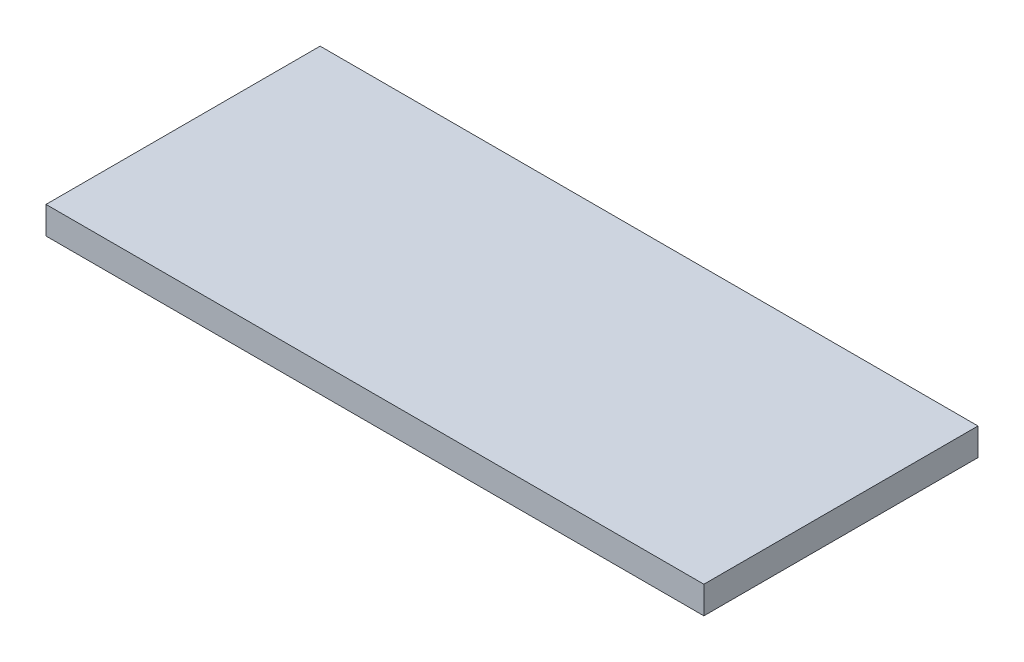
ISO-10303-21;
HEADER;
FILE_DESCRIPTION(('STEP AP214'),'2;1');
FILE_NAME('part.step','',(''),(''),'','','');
FILE_SCHEMA(('AUTOMOTIVE_DESIGN { 1 0 10303 214 1 1 1 1 }'));
ENDSEC;
DATA;
#1=APPLICATION_CONTEXT('core data for automotive mechanical design processes');
#2=APPLICATION_PROTOCOL_DEFINITION('international standard','automotive_design',2000,#1);
#3=PRODUCT_CONTEXT('',#1,'mechanical');
#4=PRODUCT('Part','Part','',(#3));
#5=PRODUCT_RELATED_PRODUCT_CATEGORY('part','',(#4));
#6=PRODUCT_DEFINITION_FORMATION('','',#4);
#7=PRODUCT_DEFINITION_CONTEXT('part definition',#1,'design');
#8=PRODUCT_DEFINITION('design','',#6,#7);
#9=PRODUCT_DEFINITION_SHAPE('','',#8);
#10=(LENGTH_UNIT() NAMED_UNIT(*) SI_UNIT(.MILLI.,.METRE.));
#11=(NAMED_UNIT(*) PLANE_ANGLE_UNIT() SI_UNIT($,.RADIAN.));
#12=(NAMED_UNIT(*) SI_UNIT($,.STERADIAN.) SOLID_ANGLE_UNIT());
#13=UNCERTAINTY_MEASURE_WITH_UNIT(LENGTH_MEASURE(1.E-05),#10,'distance_accuracy_value','');
#14=(GEOMETRIC_REPRESENTATION_CONTEXT(3) GLOBAL_UNCERTAINTY_ASSIGNED_CONTEXT((#13)) GLOBAL_UNIT_ASSIGNED_CONTEXT((#10,
#11,#12)) REPRESENTATION_CONTEXT('',''));
#15=CARTESIAN_POINT('',(0.,0.,0.));
#16=DIRECTION('',(0.,0.,1.));
#17=DIRECTION('',(1.,0.,0.));
#18=AXIS2_PLACEMENT_3D('',#15,#16,#17);
#19=CARTESIAN_POINT('',(76.2,6.35,-31.75));
#20=DIRECTION('',(-1.,0.,0.));
#21=DIRECTION('',(0.,0.,1.));
#22=AXIS2_PLACEMENT_3D('',#19,#20,#21);
#23=PLANE('',#22);
#24=DIRECTION('',(0.,0.,-1.));
#25=VECTOR('',#24,1.);
#26=CARTESIAN_POINT('',(76.2,0.,-31.75));
#27=LINE('',#26,#25);
#28=CARTESIAN_POINT('',(76.2,0.,31.75));
#29=VERTEX_POINT('',#28);
#30=CARTESIAN_POINT('',(76.2,0.,-31.75));
#31=VERTEX_POINT('',#30);
#32=EDGE_CURVE('E95',#29,#31,#27,.T.);
#33=ORIENTED_EDGE('',*,*,#32,.T.);
#34=DIRECTION('',(0.,-1.,0.));
#35=VECTOR('',#34,1.);
#36=CARTESIAN_POINT('',(76.2,6.35,-31.75));
#37=LINE('',#36,#35);
#38=CARTESIAN_POINT('',(76.2,6.35,-31.75));
#39=VERTEX_POINT('',#38);
#40=EDGE_CURVE('E11',#39,#31,#37,.T.);
#41=ORIENTED_EDGE('',*,*,#40,.F.);
#42=DIRECTION('',(0.,0.,-1.));
#43=VECTOR('',#42,1.);
#44=CARTESIAN_POINT('',(76.2,6.35,-31.75));
#45=LINE('',#44,#43);
#46=CARTESIAN_POINT('',(76.2,6.35,31.75));
#47=VERTEX_POINT('',#46);
#48=EDGE_CURVE('E83',#47,#39,#45,.T.);
#49=ORIENTED_EDGE('',*,*,#48,.F.);
#50=DIRECTION('',(0.,-1.,0.));
#51=VECTOR('',#50,1.);
#52=CARTESIAN_POINT('',(76.2,6.35,31.75));
#53=LINE('',#52,#51);
#54=EDGE_CURVE('E91',#47,#29,#53,.T.);
#55=ORIENTED_EDGE('',*,*,#54,.T.);
#56=EDGE_LOOP('',(#33,#41,#49,#55));
#57=FACE_BOUND('',#56,.T.);
#58=ADVANCED_FACE('F32',(#57),#23,.F.);
#59=CARTESIAN_POINT('',(-76.2,6.35,-31.75));
#60=DIRECTION('',(0.,0.,1.));
#61=DIRECTION('',(1.,0.,0.));
#62=AXIS2_PLACEMENT_3D('',#59,#60,#61);
#63=PLANE('',#62);
#64=DIRECTION('',(-1.,0.,0.));
#65=VECTOR('',#64,1.);
#66=CARTESIAN_POINT('',(-76.2,0.,-31.75));
#67=LINE('',#66,#65);
#68=CARTESIAN_POINT('',(-76.2,0.,-31.75));
#69=VERTEX_POINT('',#68);
#70=EDGE_CURVE('E87',#31,#69,#67,.T.);
#71=ORIENTED_EDGE('',*,*,#70,.T.);
#72=DIRECTION('',(0.,-1.,0.));
#73=VECTOR('',#72,1.);
#74=CARTESIAN_POINT('',(-76.2,6.35,-31.75));
#75=LINE('',#74,#73);
#76=CARTESIAN_POINT('',(-76.2,6.35,-31.75));
#77=VERTEX_POINT('',#76);
#78=EDGE_CURVE('E40',#77,#69,#75,.T.);
#79=ORIENTED_EDGE('',*,*,#78,.F.);
#80=DIRECTION('',(-1.,0.,0.));
#81=VECTOR('',#80,1.);
#82=CARTESIAN_POINT('',(-76.2,6.35,-31.75));
#83=LINE('',#82,#81);
#84=EDGE_CURVE('E78',#39,#77,#83,.T.);
#85=ORIENTED_EDGE('',*,*,#84,.F.);
#86=ORIENTED_EDGE('',*,*,#40,.T.);
#87=EDGE_LOOP('',(#71,#79,#85,#86));
#88=FACE_BOUND('',#87,.T.);
#89=ADVANCED_FACE('F86',(#88),#63,.F.);
#90=CARTESIAN_POINT('',(-76.2,6.35,-31.75));
#91=DIRECTION('',(1.,0.,0.));
#92=DIRECTION('',(0.,0.,-1.));
#93=AXIS2_PLACEMENT_3D('',#90,#91,#92);
#94=PLANE('',#93);
#95=DIRECTION('',(0.,0.,1.));
#96=VECTOR('',#95,1.);
#97=CARTESIAN_POINT('',(-76.2,0.,-31.75));
#98=LINE('',#97,#96);
#99=CARTESIAN_POINT('',(-76.2,0.,31.75));
#100=VERTEX_POINT('',#99);
#101=EDGE_CURVE('E65',#69,#100,#98,.T.);
#102=ORIENTED_EDGE('',*,*,#101,.T.);
#103=DIRECTION('',(0.,-1.,0.));
#104=VECTOR('',#103,1.);
#105=CARTESIAN_POINT('',(-76.2,6.35,31.75));
#106=LINE('',#105,#104);
#107=CARTESIAN_POINT('',(-76.2,6.35,31.75));
#108=VERTEX_POINT('',#107);
#109=EDGE_CURVE('E88',#108,#100,#106,.T.);
#110=ORIENTED_EDGE('',*,*,#109,.F.);
#111=DIRECTION('',(0.,0.,1.));
#112=VECTOR('',#111,1.);
#113=CARTESIAN_POINT('',(-76.2,6.35,-31.75));
#114=LINE('',#113,#112);
#115=EDGE_CURVE('E81',#77,#108,#114,.T.);
#116=ORIENTED_EDGE('',*,*,#115,.F.);
#117=ORIENTED_EDGE('',*,*,#78,.T.);
#118=EDGE_LOOP('',(#102,#110,#116,#117));
#119=FACE_BOUND('',#118,.T.);
#120=ADVANCED_FACE('F89',(#119),#94,.F.);
#121=CARTESIAN_POINT('',(-76.2,6.35,31.75));
#122=DIRECTION('',(0.,0.,-1.));
#123=DIRECTION('',(-1.,0.,0.));
#124=AXIS2_PLACEMENT_3D('',#121,#122,#123);
#125=PLANE('',#124);
#126=DIRECTION('',(1.,0.,0.));
#127=VECTOR('',#126,1.);
#128=CARTESIAN_POINT('',(-76.2,0.,31.75));
#129=LINE('',#128,#127);
#130=EDGE_CURVE('E71',#100,#29,#129,.T.);
#131=ORIENTED_EDGE('',*,*,#130,.T.);
#132=ORIENTED_EDGE('',*,*,#54,.F.);
#133=DIRECTION('',(1.,0.,0.));
#134=VECTOR('',#133,1.);
#135=CARTESIAN_POINT('',(-76.2,6.35,31.75));
#136=LINE('',#135,#134);
#137=EDGE_CURVE('E48',#108,#47,#136,.T.);
#138=ORIENTED_EDGE('',*,*,#137,.F.);
#139=ORIENTED_EDGE('',*,*,#109,.T.);
#140=EDGE_LOOP('',(#131,#132,#138,#139));
#141=FACE_BOUND('',#140,.T.);
#142=ADVANCED_FACE('F102',(#141),#125,.F.);
#143=CARTESIAN_POINT('',(0.,6.35,0.));
#144=DIRECTION('',(0.,1.,0.));
#145=DIRECTION('',(0.,0.,1.));
#146=AXIS2_PLACEMENT_3D('',#143,#144,#145);
#147=PLANE('',#146);
#148=ORIENTED_EDGE('',*,*,#48,.T.);
#149=ORIENTED_EDGE('',*,*,#84,.T.);
#150=ORIENTED_EDGE('',*,*,#115,.T.);
#151=ORIENTED_EDGE('',*,*,#137,.T.);
#152=EDGE_LOOP('',(#148,#149,#150,#151));
#153=FACE_BOUND('',#152,.T.);
#154=ADVANCED_FACE('F79',(#153),#147,.T.);
#155=CARTESIAN_POINT('',(0.,0.,0.));
#156=DIRECTION('',(0.,1.,0.));
#157=DIRECTION('',(0.,0.,1.));
#158=AXIS2_PLACEMENT_3D('',#155,#156,#157);
#159=PLANE('',#158);
#160=ORIENTED_EDGE('',*,*,#32,.F.);
#161=ORIENTED_EDGE('',*,*,#130,.F.);
#162=ORIENTED_EDGE('',*,*,#101,.F.);
#163=ORIENTED_EDGE('',*,*,#70,.F.);
#164=EDGE_LOOP('',(#160,#161,#162,#163));
#165=FACE_BOUND('',#164,.T.);
#166=ADVANCED_FACE('F105',(#165),#159,.F.);
#167=CLOSED_SHELL('',(#58,#89,#120,#142,#154,#166));
#168=MANIFOLD_SOLID_BREP('B2',#167);
#169=ADVANCED_BREP_SHAPE_REPRESENTATION('',(#18,#168),#14);
#170=SHAPE_DEFINITION_REPRESENTATION(#9,#169);
ENDSEC;
END-ISO-10303-21;
